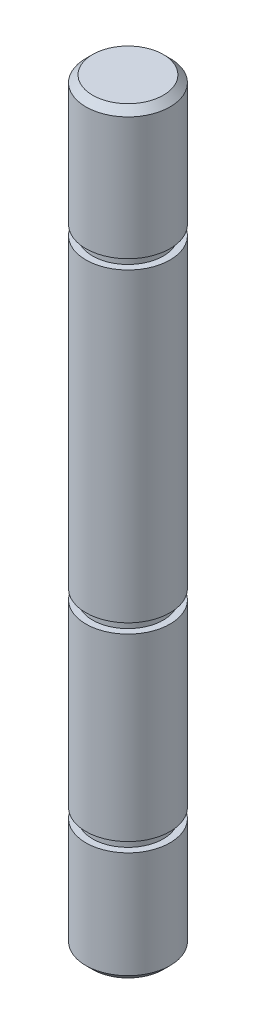
ISO-10303-21;
HEADER;
FILE_DESCRIPTION(('STEP AP214'),'2;1');
FILE_NAME('part.step','',(''),(''),'','','');
FILE_SCHEMA(('AUTOMOTIVE_DESIGN { 1 0 10303 214 1 1 1 1 }'));
ENDSEC;
DATA;
#1=APPLICATION_CONTEXT('core data for automotive mechanical design processes');
#2=APPLICATION_PROTOCOL_DEFINITION('international standard','automotive_design',2000,#1);
#3=PRODUCT_CONTEXT('',#1,'mechanical');
#4=PRODUCT('Part','Part','',(#3));
#5=PRODUCT_RELATED_PRODUCT_CATEGORY('part','',(#4));
#6=PRODUCT_DEFINITION_FORMATION('','',#4);
#7=PRODUCT_DEFINITION_CONTEXT('part definition',#1,'design');
#8=PRODUCT_DEFINITION('design','',#6,#7);
#9=PRODUCT_DEFINITION_SHAPE('','',#8);
#10=(LENGTH_UNIT() NAMED_UNIT(*) SI_UNIT(.MILLI.,.METRE.));
#11=(NAMED_UNIT(*) PLANE_ANGLE_UNIT() SI_UNIT($,.RADIAN.));
#12=(NAMED_UNIT(*) SI_UNIT($,.STERADIAN.) SOLID_ANGLE_UNIT());
#13=UNCERTAINTY_MEASURE_WITH_UNIT(LENGTH_MEASURE(1.E-05),#10,'distance_accuracy_value','');
#14=(GEOMETRIC_REPRESENTATION_CONTEXT(3) GLOBAL_UNCERTAINTY_ASSIGNED_CONTEXT((#13)) GLOBAL_UNIT_ASSIGNED_CONTEXT((#10,
#11,#12)) REPRESENTATION_CONTEXT('',''));
#15=CARTESIAN_POINT('',(0.,0.,0.));
#16=DIRECTION('',(0.,0.,1.));
#17=DIRECTION('',(1.,0.,0.));
#18=AXIS2_PLACEMENT_3D('',#15,#16,#17);
#19=CARTESIAN_POINT('',(0.,57.15,0.));
#20=DIRECTION('',(0.,1.,0.));
#21=DIRECTION('',(0.,0.,1.));
#22=AXIS2_PLACEMENT_3D('',#19,#20,#21);
#23=PLANE('',#22);
#24=CARTESIAN_POINT('',(0.,57.15,0.));
#25=DIRECTION('',(0.,1.,0.));
#26=DIRECTION('',(0.,0.,1.));
#27=AXIS2_PLACEMENT_3D('',#24,#25,#26);
#28=CIRCLE('',#27,2.66699999999999);
#29=CARTESIAN_POINT('',(0.,57.15,2.66699999999999));
#30=VERTEX_POINT('',#29);
#31=EDGE_CURVE('E56',#30,#30,#28,.T.);
#32=ORIENTED_EDGE('',*,*,#31,.T.);
#33=EDGE_LOOP('',(#32));
#34=FACE_BOUND('',#33,.T.);
#35=ADVANCED_FACE('F49',(#34),#23,.T.);
#36=CARTESIAN_POINT('',(0.,0.,0.));
#37=DIRECTION('',(0.,1.,0.));
#38=DIRECTION('',(0.,0.,1.));
#39=AXIS2_PLACEMENT_3D('',#36,#37,#38);
#40=CYLINDRICAL_SURFACE('',#39,3.175);
#41=CARTESIAN_POINT('',(0.,56.642,0.));
#42=DIRECTION('',(0.,1.,0.));
#43=DIRECTION('',(0.,0.,1.));
#44=AXIS2_PLACEMENT_3D('',#41,#42,#43);
#45=CIRCLE('',#44,3.175);
#46=CARTESIAN_POINT('',(0.,56.642,3.175));
#47=VERTEX_POINT('',#46);
#48=EDGE_CURVE('E12',#47,#47,#45,.F.);
#49=ORIENTED_EDGE('',*,*,#48,.T.);
#50=EDGE_LOOP('',(#49));
#51=FACE_BOUND('',#50,.T.);
#52=CARTESIAN_POINT('',(0.,47.3738,0.));
#53=DIRECTION('',(0.,1.,0.));
#54=DIRECTION('',(0.,0.,1.));
#55=AXIS2_PLACEMENT_3D('',#52,#53,#54);
#56=CIRCLE('',#55,3.175);
#57=CARTESIAN_POINT('',(0.,47.3738,3.175));
#58=VERTEX_POINT('',#57);
#59=EDGE_CURVE('E69',#58,#58,#56,.T.);
#60=ORIENTED_EDGE('',*,*,#59,.T.);
#61=EDGE_LOOP('',(#60));
#62=FACE_BOUND('',#61,.T.);
#63=ADVANCED_FACE('F124',(#51,#62),#40,.T.);
#64=CARTESIAN_POINT('',(-3.17499999999998,47.3738,0.));
#65=DIRECTION('',(0.,-1.,0.));
#66=DIRECTION('',(0.,0.,-1.));
#67=AXIS2_PLACEMENT_3D('',#64,#65,#66);
#68=PLANE('',#67);
#69=CARTESIAN_POINT('',(0.,47.3738,0.));
#70=DIRECTION('',(0.,1.,0.));
#71=DIRECTION('',(0.,0.,1.));
#72=AXIS2_PLACEMENT_3D('',#69,#70,#71);
#73=CIRCLE('',#72,2.66700000000001);
#74=CARTESIAN_POINT('',(0.,47.3738,2.66700000000001));
#75=VERTEX_POINT('',#74);
#76=EDGE_CURVE('E72',#75,#75,#73,.T.);
#77=ORIENTED_EDGE('',*,*,#76,.T.);
#78=EDGE_LOOP('',(#77));
#79=FACE_BOUND('',#78,.T.);
#80=ORIENTED_EDGE('',*,*,#59,.F.);
#81=EDGE_LOOP('',(#80));
#82=FACE_BOUND('',#81,.T.);
#83=ADVANCED_FACE('F129',(#79,#82),#68,.T.);
#84=CARTESIAN_POINT('',(0.,0.,0.));
#85=DIRECTION('',(0.,1.,0.));
#86=DIRECTION('',(0.,0.,1.));
#87=AXIS2_PLACEMENT_3D('',#84,#85,#86);
#88=CYLINDRICAL_SURFACE('',#87,2.66700000000001);
#89=CARTESIAN_POINT('',(0.,46.6372,0.));
#90=DIRECTION('',(0.,1.,0.));
#91=DIRECTION('',(0.,0.,1.));
#92=AXIS2_PLACEMENT_3D('',#89,#90,#91);
#93=CIRCLE('',#92,2.667);
#94=CARTESIAN_POINT('',(0.,46.6372,2.66699999999996));
#95=VERTEX_POINT('',#94);
#96=EDGE_CURVE('E75',#95,#95,#93,.T.);
#97=ORIENTED_EDGE('',*,*,#96,.T.);
#98=EDGE_LOOP('',(#97));
#99=FACE_BOUND('',#98,.T.);
#100=ORIENTED_EDGE('',*,*,#76,.F.);
#101=EDGE_LOOP('',(#100));
#102=FACE_BOUND('',#101,.T.);
#103=ADVANCED_FACE('F219',(#99,#102),#88,.T.);
#104=CARTESIAN_POINT('',(-3.17499999999998,46.6372,0.));
#105=DIRECTION('',(0.,1.,0.));
#106=DIRECTION('',(0.,0.,1.));
#107=AXIS2_PLACEMENT_3D('',#104,#105,#106);
#108=PLANE('',#107);
#109=CARTESIAN_POINT('',(0.,46.6372,0.));
#110=DIRECTION('',(0.,1.,0.));
#111=DIRECTION('',(0.,0.,1.));
#112=AXIS2_PLACEMENT_3D('',#109,#110,#111);
#113=CIRCLE('',#112,3.175);
#114=CARTESIAN_POINT('',(0.,46.6372,3.17499999999996));
#115=VERTEX_POINT('',#114);
#116=EDGE_CURVE('E78',#115,#115,#113,.T.);
#117=ORIENTED_EDGE('',*,*,#116,.T.);
#118=EDGE_LOOP('',(#117));
#119=FACE_BOUND('',#118,.T.);
#120=ORIENTED_EDGE('',*,*,#96,.F.);
#121=EDGE_LOOP('',(#120));
#122=FACE_BOUND('',#121,.T.);
#123=ADVANCED_FACE('F211',(#119,#122),#108,.T.);
#124=CARTESIAN_POINT('',(0.,0.,0.));
#125=DIRECTION('',(0.,1.,0.));
#126=DIRECTION('',(0.,0.,1.));
#127=AXIS2_PLACEMENT_3D('',#124,#125,#126);
#128=CYLINDRICAL_SURFACE('',#127,3.175);
#129=CARTESIAN_POINT('',(0.,23.574,0.));
#130=DIRECTION('',(0.,1.,0.));
#131=DIRECTION('',(0.,0.,1.));
#132=AXIS2_PLACEMENT_3D('',#129,#130,#131);
#133=CIRCLE('',#132,3.175);
#134=CARTESIAN_POINT('',(0.,23.574,3.175));
#135=VERTEX_POINT('',#134);
#136=EDGE_CURVE('E81',#135,#135,#133,.T.);
#137=ORIENTED_EDGE('',*,*,#136,.T.);
#138=EDGE_LOOP('',(#137));
#139=FACE_BOUND('',#138,.T.);
#140=ORIENTED_EDGE('',*,*,#116,.F.);
#141=EDGE_LOOP('',(#140));
#142=FACE_BOUND('',#141,.T.);
#143=ADVANCED_FACE('F203',(#139,#142),#128,.T.);
#144=CARTESIAN_POINT('',(-3.17499999999998,23.574,0.));
#145=DIRECTION('',(0.,-1.,0.));
#146=DIRECTION('',(0.,0.,-1.));
#147=AXIS2_PLACEMENT_3D('',#144,#145,#146);
#148=PLANE('',#147);
#149=CARTESIAN_POINT('',(0.,23.574,0.));
#150=DIRECTION('',(0.,1.,0.));
#151=DIRECTION('',(0.,0.,1.));
#152=AXIS2_PLACEMENT_3D('',#149,#150,#151);
#153=CIRCLE('',#152,2.667);
#154=CARTESIAN_POINT('',(0.,23.574,2.667));
#155=VERTEX_POINT('',#154);
#156=EDGE_CURVE('E84',#155,#155,#153,.T.);
#157=ORIENTED_EDGE('',*,*,#156,.T.);
#158=EDGE_LOOP('',(#157));
#159=FACE_BOUND('',#158,.T.);
#160=ORIENTED_EDGE('',*,*,#136,.F.);
#161=EDGE_LOOP('',(#160));
#162=FACE_BOUND('',#161,.T.);
#163=ADVANCED_FACE('F195',(#159,#162),#148,.T.);
#164=CARTESIAN_POINT('',(0.,0.,0.));
#165=DIRECTION('',(0.,1.,0.));
#166=DIRECTION('',(0.,0.,1.));
#167=AXIS2_PLACEMENT_3D('',#164,#165,#166);
#168=CYLINDRICAL_SURFACE('',#167,2.667);
#169=CARTESIAN_POINT('',(0.,22.8374,0.));
#170=DIRECTION('',(0.,1.,0.));
#171=DIRECTION('',(0.,0.,1.));
#172=AXIS2_PLACEMENT_3D('',#169,#170,#171);
#173=CIRCLE('',#172,2.667);
#174=CARTESIAN_POINT('',(0.,22.8374,2.66699999999996));
#175=VERTEX_POINT('',#174);
#176=EDGE_CURVE('E87',#175,#175,#173,.T.);
#177=ORIENTED_EDGE('',*,*,#176,.T.);
#178=EDGE_LOOP('',(#177));
#179=FACE_BOUND('',#178,.T.);
#180=ORIENTED_EDGE('',*,*,#156,.F.);
#181=EDGE_LOOP('',(#180));
#182=FACE_BOUND('',#181,.T.);
#183=ADVANCED_FACE('F187',(#179,#182),#168,.T.);
#184=CARTESIAN_POINT('',(-3.17499999999998,22.8374,0.));
#185=DIRECTION('',(0.,1.,0.));
#186=DIRECTION('',(0.,0.,1.));
#187=AXIS2_PLACEMENT_3D('',#184,#185,#186);
#188=PLANE('',#187);
#189=CARTESIAN_POINT('',(0.,22.8374,0.));
#190=DIRECTION('',(0.,1.,0.));
#191=DIRECTION('',(0.,0.,1.));
#192=AXIS2_PLACEMENT_3D('',#189,#190,#191);
#193=CIRCLE('',#192,3.175);
#194=CARTESIAN_POINT('',(0.,22.8374,3.17499999999996));
#195=VERTEX_POINT('',#194);
#196=EDGE_CURVE('E90',#195,#195,#193,.T.);
#197=ORIENTED_EDGE('',*,*,#196,.T.);
#198=EDGE_LOOP('',(#197));
#199=FACE_BOUND('',#198,.T.);
#200=ORIENTED_EDGE('',*,*,#176,.F.);
#201=EDGE_LOOP('',(#200));
#202=FACE_BOUND('',#201,.T.);
#203=ADVANCED_FACE('F179',(#199,#202),#188,.T.);
#204=CARTESIAN_POINT('',(0.,0.,0.));
#205=DIRECTION('',(0.,1.,0.));
#206=DIRECTION('',(0.,0.,1.));
#207=AXIS2_PLACEMENT_3D('',#204,#205,#206);
#208=CYLINDRICAL_SURFACE('',#207,3.175);
#209=CARTESIAN_POINT('',(0.,9.2738,0.));
#210=DIRECTION('',(0.,1.,0.));
#211=DIRECTION('',(0.,0.,1.));
#212=AXIS2_PLACEMENT_3D('',#209,#210,#211);
#213=CIRCLE('',#212,3.175);
#214=CARTESIAN_POINT('',(0.,9.2738,3.175));
#215=VERTEX_POINT('',#214);
#216=EDGE_CURVE('E93',#215,#215,#213,.T.);
#217=ORIENTED_EDGE('',*,*,#216,.T.);
#218=EDGE_LOOP('',(#217));
#219=FACE_BOUND('',#218,.T.);
#220=ORIENTED_EDGE('',*,*,#196,.F.);
#221=EDGE_LOOP('',(#220));
#222=FACE_BOUND('',#221,.T.);
#223=ADVANCED_FACE('F171',(#219,#222),#208,.T.);
#224=CARTESIAN_POINT('',(-3.17499999999998,9.2738,0.));
#225=DIRECTION('',(0.,-1.,0.));
#226=DIRECTION('',(0.,0.,-1.));
#227=AXIS2_PLACEMENT_3D('',#224,#225,#226);
#228=PLANE('',#227);
#229=CARTESIAN_POINT('',(0.,9.2738,0.));
#230=DIRECTION('',(0.,1.,0.));
#231=DIRECTION('',(0.,0.,1.));
#232=AXIS2_PLACEMENT_3D('',#229,#230,#231);
#233=CIRCLE('',#232,2.667);
#234=CARTESIAN_POINT('',(0.,9.2738,2.667));
#235=VERTEX_POINT('',#234);
#236=EDGE_CURVE('E96',#235,#235,#233,.T.);
#237=ORIENTED_EDGE('',*,*,#236,.T.);
#238=EDGE_LOOP('',(#237));
#239=FACE_BOUND('',#238,.T.);
#240=ORIENTED_EDGE('',*,*,#216,.F.);
#241=EDGE_LOOP('',(#240));
#242=FACE_BOUND('',#241,.T.);
#243=ADVANCED_FACE('F163',(#239,#242),#228,.T.);
#244=CARTESIAN_POINT('',(0.,0.,0.));
#245=DIRECTION('',(0.,1.,0.));
#246=DIRECTION('',(0.,0.,1.));
#247=AXIS2_PLACEMENT_3D('',#244,#245,#246);
#248=CYLINDRICAL_SURFACE('',#247,2.667);
#249=CARTESIAN_POINT('',(0.,8.53720000000002,0.));
#250=DIRECTION('',(0.,1.,0.));
#251=DIRECTION('',(0.,0.,1.));
#252=AXIS2_PLACEMENT_3D('',#249,#250,#251);
#253=CIRCLE('',#252,2.667);
#254=CARTESIAN_POINT('',(0.,8.53720000000002,2.66699999999996));
#255=VERTEX_POINT('',#254);
#256=EDGE_CURVE('E99',#255,#255,#253,.T.);
#257=ORIENTED_EDGE('',*,*,#256,.T.);
#258=EDGE_LOOP('',(#257));
#259=FACE_BOUND('',#258,.T.);
#260=ORIENTED_EDGE('',*,*,#236,.F.);
#261=EDGE_LOOP('',(#260));
#262=FACE_BOUND('',#261,.T.);
#263=ADVANCED_FACE('F121',(#259,#262),#248,.T.);
#264=CARTESIAN_POINT('',(-3.17499999999998,8.53720000000002,0.));
#265=DIRECTION('',(0.,1.,0.));
#266=DIRECTION('',(0.,0.,1.));
#267=AXIS2_PLACEMENT_3D('',#264,#265,#266);
#268=PLANE('',#267);
#269=CARTESIAN_POINT('',(0.,8.53720000000002,0.));
#270=DIRECTION('',(0.,1.,0.));
#271=DIRECTION('',(0.,0.,1.));
#272=AXIS2_PLACEMENT_3D('',#269,#270,#271);
#273=CIRCLE('',#272,3.175);
#274=CARTESIAN_POINT('',(0.,8.53720000000002,3.17499999999996));
#275=VERTEX_POINT('',#274);
#276=EDGE_CURVE('E102',#275,#275,#273,.T.);
#277=ORIENTED_EDGE('',*,*,#276,.T.);
#278=EDGE_LOOP('',(#277));
#279=FACE_BOUND('',#278,.T.);
#280=ORIENTED_EDGE('',*,*,#256,.F.);
#281=EDGE_LOOP('',(#280));
#282=FACE_BOUND('',#281,.T.);
#283=ADVANCED_FACE('F106',(#279,#282),#268,.T.);
#284=CARTESIAN_POINT('',(0.,0.,0.));
#285=DIRECTION('',(0.,1.,0.));
#286=DIRECTION('',(0.,0.,1.));
#287=AXIS2_PLACEMENT_3D('',#284,#285,#286);
#288=CYLINDRICAL_SURFACE('',#287,3.175);
#289=CARTESIAN_POINT('',(0.,0.508000000000008,0.));
#290=DIRECTION('',(0.,-1.,0.));
#291=DIRECTION('',(0.,0.,-1.));
#292=AXIS2_PLACEMENT_3D('',#289,#290,#291);
#293=CIRCLE('',#292,3.175);
#294=CARTESIAN_POINT('',(0.,0.508000000000008,-3.17500000000004));
#295=VERTEX_POINT('',#294);
#296=EDGE_CURVE('E64',#295,#295,#293,.F.);
#297=ORIENTED_EDGE('',*,*,#296,.T.);
#298=EDGE_LOOP('',(#297));
#299=FACE_BOUND('',#298,.T.);
#300=ORIENTED_EDGE('',*,*,#276,.F.);
#301=EDGE_LOOP('',(#300));
#302=FACE_BOUND('',#301,.T.);
#303=ADVANCED_FACE('F109',(#299,#302),#288,.T.);
#304=CARTESIAN_POINT('',(0.,0.,0.));
#305=DIRECTION('',(0.,-1.,0.));
#306=DIRECTION('',(0.,0.,-1.));
#307=AXIS2_PLACEMENT_3D('',#304,#305,#306);
#308=PLANE('',#307);
#309=CARTESIAN_POINT('',(0.,0.,0.));
#310=DIRECTION('',(0.,-1.,0.));
#311=DIRECTION('',(0.,0.,-1.));
#312=AXIS2_PLACEMENT_3D('',#309,#310,#311);
#313=CIRCLE('',#312,2.667);
#314=CARTESIAN_POINT('',(0.,0.,-2.667));
#315=VERTEX_POINT('',#314);
#316=EDGE_CURVE('E60',#315,#315,#313,.T.);
#317=ORIENTED_EDGE('',*,*,#316,.T.);
#318=EDGE_LOOP('',(#317));
#319=FACE_BOUND('',#318,.T.);
#320=ADVANCED_FACE('F111',(#319),#308,.T.);
#321=CARTESIAN_POINT('',(0.,0.508000000000008,0.));
#322=DIRECTION('',(0.,1.,0.));
#323=DIRECTION('',(0.,0.,1.));
#324=AXIS2_PLACEMENT_3D('',#321,#322,#323);
#325=CONICAL_SURFACE('',#324,3.175,0.785398163397445);
#326=ORIENTED_EDGE('',*,*,#316,.F.);
#327=EDGE_LOOP('',(#326));
#328=FACE_BOUND('',#327,.T.);
#329=ORIENTED_EDGE('',*,*,#296,.F.);
#330=EDGE_LOOP('',(#329));
#331=FACE_BOUND('',#330,.T.);
#332=ADVANCED_FACE('F118',(#328,#331),#325,.T.);
#333=CARTESIAN_POINT('',(0.,57.15,0.));
#334=DIRECTION('',(0.,-1.,0.));
#335=DIRECTION('',(0.,0.,-1.));
#336=AXIS2_PLACEMENT_3D('',#333,#334,#335);
#337=CONICAL_SURFACE('',#336,2.66699999999999,0.785398163397451);
#338=ORIENTED_EDGE('',*,*,#48,.F.);
#339=EDGE_LOOP('',(#338));
#340=FACE_BOUND('',#339,.T.);
#341=ORIENTED_EDGE('',*,*,#31,.F.);
#342=EDGE_LOOP('',(#341));
#343=FACE_BOUND('',#342,.T.);
#344=ADVANCED_FACE('F51',(#340,#343),#337,.T.);
#345=CLOSED_SHELL('',(#35,#63,#83,#103,#123,#143,#163,#183,#203,#223,#243,#263,#283,#303,#320,
#332,#344));
#346=MANIFOLD_SOLID_BREP('B2',#345);
#347=ADVANCED_BREP_SHAPE_REPRESENTATION('',(#18,#346),#14);
#348=SHAPE_DEFINITION_REPRESENTATION(#9,#347);
ENDSEC;
END-ISO-10303-21;
